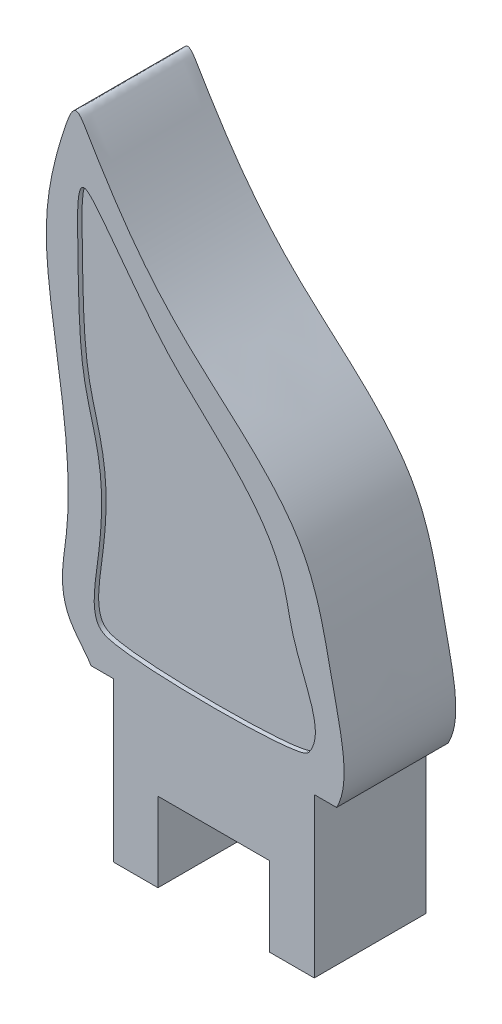
ISO-10303-21;
HEADER;
FILE_DESCRIPTION(('STEP AP214'),'2;1');
FILE_NAME('part.step','',(''),(''),'','','');
FILE_SCHEMA(('AUTOMOTIVE_DESIGN { 1 0 10303 214 1 1 1 1 }'));
ENDSEC;
DATA;
#1=APPLICATION_CONTEXT('core data for automotive mechanical design processes');
#2=APPLICATION_PROTOCOL_DEFINITION('international standard','automotive_design',2000,#1);
#3=PRODUCT_CONTEXT('',#1,'mechanical');
#4=PRODUCT('Part','Part','',(#3));
#5=PRODUCT_RELATED_PRODUCT_CATEGORY('part','',(#4));
#6=PRODUCT_DEFINITION_FORMATION('','',#4);
#7=PRODUCT_DEFINITION_CONTEXT('part definition',#1,'design');
#8=PRODUCT_DEFINITION('design','',#6,#7);
#9=PRODUCT_DEFINITION_SHAPE('','',#8);
#10=(LENGTH_UNIT() NAMED_UNIT(*) SI_UNIT(.MILLI.,.METRE.));
#11=(NAMED_UNIT(*) PLANE_ANGLE_UNIT() SI_UNIT($,.RADIAN.));
#12=(NAMED_UNIT(*) SI_UNIT($,.STERADIAN.) SOLID_ANGLE_UNIT());
#13=UNCERTAINTY_MEASURE_WITH_UNIT(LENGTH_MEASURE(1.E-05),#10,'distance_accuracy_value','');
#14=(GEOMETRIC_REPRESENTATION_CONTEXT(3) GLOBAL_UNCERTAINTY_ASSIGNED_CONTEXT((#13)) GLOBAL_UNIT_ASSIGNED_CONTEXT((#10,
#11,#12)) REPRESENTATION_CONTEXT('',''));
#15=CARTESIAN_POINT('',(0.,0.,0.));
#16=DIRECTION('',(0.,0.,1.));
#17=DIRECTION('',(1.,0.,0.));
#18=AXIS2_PLACEMENT_3D('',#15,#16,#17);
#19=CARTESIAN_POINT('',(-26.5426129547652,-9.52823658466999,13.5506965832842));
#20=DIRECTION('',(0.,1.,0.));
#21=DIRECTION('',(0.,0.,1.));
#22=AXIS2_PLACEMENT_3D('',#19,#20,#21);
#23=PLANE('',#22);
#24=DIRECTION('',(-1.,0.,0.));
#25=VECTOR('',#24,1.);
#26=CARTESIAN_POINT('',(-26.5426129547652,-9.52823658466999,13.5506965832842));
#27=LINE('',#26,#25);
#28=CARTESIAN_POINT('',(-22.8426129547652,-9.52823658467004,13.5506965832842));
#29=VERTEX_POINT('',#28);
#30=CARTESIAN_POINT('',(-23.8426129547652,-9.52823658467002,13.5506965832842));
#31=VERTEX_POINT('',#30);
#32=EDGE_CURVE('E156',#29,#31,#27,.T.);
#33=ORIENTED_EDGE('',*,*,#32,.T.);
#34=DIRECTION('',(0.,0.,1.));
#35=VECTOR('',#34,1.);
#36=CARTESIAN_POINT('',(-23.8426129547652,-9.52823658467002,11.0506965832842));
#37=LINE('',#36,#35);
#38=CARTESIAN_POINT('',(-23.8426129547652,-9.52823658467002,11.0506965832842));
#39=VERTEX_POINT('',#38);
#40=EDGE_CURVE('E135',#39,#31,#37,.T.);
#41=ORIENTED_EDGE('',*,*,#40,.F.);
#42=DIRECTION('',(-1.,0.,0.));
#43=VECTOR('',#42,1.);
#44=CARTESIAN_POINT('',(-26.5426129547652,-9.52823658466999,11.0506965832842));
#45=LINE('',#44,#43);
#46=CARTESIAN_POINT('',(-22.8426129547652,-9.52823658467004,11.0506965832842));
#47=VERTEX_POINT('',#46);
#48=EDGE_CURVE('E167',#47,#39,#45,.T.);
#49=ORIENTED_EDGE('',*,*,#48,.F.);
#50=DIRECTION('',(0.,0.,-1.));
#51=VECTOR('',#50,1.);
#52=CARTESIAN_POINT('',(-22.8426129547652,-9.52823658467004,13.5506965832842));
#53=LINE('',#52,#51);
#54=EDGE_CURVE('E166',#29,#47,#53,.T.);
#55=ORIENTED_EDGE('',*,*,#54,.F.);
#56=EDGE_LOOP('',(#33,#41,#49,#55));
#57=FACE_BOUND('',#56,.T.);
#58=ADVANCED_FACE('F43',(#57),#23,.F.);
#59=CARTESIAN_POINT('',(-26.5426129547652,-5.97122894272822,13.5506965832842));
#60=DIRECTION('',(0.,1.,0.));
#61=DIRECTION('',(0.,0.,1.));
#62=AXIS2_PLACEMENT_3D('',#59,#60,#61);
#63=PLANE('',#62);
#64=DIRECTION('',(0.,0.,-1.));
#65=VECTOR('',#64,1.);
#66=CARTESIAN_POINT('',(-27.3426129547652,-5.97122894272821,13.5506965832842));
#67=LINE('',#66,#65);
#68=CARTESIAN_POINT('',(-27.3426129547652,-5.97122894272821,13.5506965832842));
#69=VERTEX_POINT('',#68);
#70=CARTESIAN_POINT('',(-27.3426129547652,-5.97122894272821,11.0506965832842));
#71=VERTEX_POINT('',#70);
#72=EDGE_CURVE('E185',#69,#71,#67,.T.);
#73=ORIENTED_EDGE('',*,*,#72,.F.);
#74=DIRECTION('',(-1.,0.,0.));
#75=VECTOR('',#74,1.);
#76=CARTESIAN_POINT('',(-26.5426129547652,-5.97122894272822,13.5506965832842));
#77=LINE('',#76,#75);
#78=CARTESIAN_POINT('',(-27.8426129547652,-5.9712289427282,13.5506965832842));
#79=VERTEX_POINT('',#78);
#80=EDGE_CURVE('E234',#69,#79,#77,.T.);
#81=ORIENTED_EDGE('',*,*,#80,.T.);
#82=DIRECTION('',(0.,0.,-1.));
#83=VECTOR('',#82,1.);
#84=CARTESIAN_POINT('',(-27.8426129547652,-5.9712289427282,13.5506965832842));
#85=LINE('',#84,#83);
#86=CARTESIAN_POINT('',(-27.8426129547652,-5.9712289427282,11.0506965832842));
#87=VERTEX_POINT('',#86);
#88=EDGE_CURVE('E53',#79,#87,#85,.T.);
#89=ORIENTED_EDGE('',*,*,#88,.T.);
#90=DIRECTION('',(-1.,0.,0.));
#91=VECTOR('',#90,1.);
#92=CARTESIAN_POINT('',(-26.5426129547652,-5.97122894272822,11.0506965832842));
#93=LINE('',#92,#91);
#94=EDGE_CURVE('E236',#71,#87,#93,.T.);
#95=ORIENTED_EDGE('',*,*,#94,.F.);
#96=EDGE_LOOP('',(#73,#81,#89,#95));
#97=FACE_BOUND('',#96,.T.);
#98=ADVANCED_FACE('F219',(#97),#63,.F.);
#99=DIRECTION('',(0.,0.,-1.));
#100=VECTOR('',#99,1.);
#101=CARTESIAN_POINT('',(-22.8426129547652,-5.97122894272827,13.5506965832842));
#102=LINE('',#101,#100);
#103=CARTESIAN_POINT('',(-22.8426129547652,-5.97122894272827,13.5506965832842));
#104=VERTEX_POINT('',#103);
#105=CARTESIAN_POINT('',(-22.8426129547652,-5.97122894272827,11.0506965832842));
#106=VERTEX_POINT('',#105);
#107=EDGE_CURVE('E181',#104,#106,#102,.T.);
#108=ORIENTED_EDGE('',*,*,#107,.T.);
#109=CARTESIAN_POINT('',(-22.3426129547652,-5.97122894272828,11.0506965832842));
#110=VERTEX_POINT('',#109);
#111=EDGE_CURVE('E271',#110,#106,#93,.T.);
#112=ORIENTED_EDGE('',*,*,#111,.F.);
#113=DIRECTION('',(0.,0.,-1.));
#114=VECTOR('',#113,1.);
#115=CARTESIAN_POINT('',(-22.3426129547652,-5.97122894272828,13.5506965832842));
#116=LINE('',#115,#114);
#117=CARTESIAN_POINT('',(-22.3426129547652,-5.97122894272828,13.5506965832842));
#118=VERTEX_POINT('',#117);
#119=EDGE_CURVE('E11',#118,#110,#116,.T.);
#120=ORIENTED_EDGE('',*,*,#119,.F.);
#121=EDGE_CURVE('E263',#118,#104,#77,.T.);
#122=ORIENTED_EDGE('',*,*,#121,.T.);
#123=EDGE_LOOP('',(#108,#112,#120,#122));
#124=FACE_BOUND('',#123,.T.);
#125=ADVANCED_FACE('F221',(#124),#63,.F.);
#126=CARTESIAN_POINT('',(-22.3426129547652,-5.97122894272828,13.5506965832842));
#127=CARTESIAN_POINT('',(-22.0230958119888,-5.37784989323537,13.5506965832842));
#128=CARTESIAN_POINT('',(-22.476666305526,-3.5915199593753,13.5506965832842));
#129=CARTESIAN_POINT('',(-22.9043423705748,-0.946207776332204,13.5506965832842));
#130=CARTESIAN_POINT('',(-25.8610974247674,1.32350664095958,13.5506965832842));
#131=CARTESIAN_POINT('',(-27.123031369236,2.93701143766191,13.5506965832842));
#132=CARTESIAN_POINT('',(-28.2060932322281,4.80524596514836,13.5506965832842));
#133=CARTESIAN_POINT('',(-28.8429195048468,3.04117219746357,13.5506965832842));
#134=CARTESIAN_POINT('',(-28.9578405042136,0.820328884380956,13.5506965832842));
#135=CARTESIAN_POINT('',(-28.0435306222221,-2.64810633493801,13.5506965832842));
#136=CARTESIAN_POINT('',(-28.6575367971811,-5.0691905645615,13.5506965832842));
#137=CARTESIAN_POINT('',(-27.9378085228159,-5.80356095091444,13.5506965832842));
#138=CARTESIAN_POINT('',(-27.8426129547652,-5.9712289427282,13.5506965832842));
#139=B_SPLINE_CURVE_WITH_KNOTS('',3,(#126,#127,#128,#129,#130,#131,#132,#133,#134,#135,#136,
#137,#138),.UNSPECIFIED.,.F.,.F.,(4,1,1,1,1,1,1,1,1,1,4),(0.,0.0749361636008755,
0.165228530478853,0.281937543117569,0.421795129781682,0.434470620733134,0.452060542403782,
0.554607140477326,0.727323585221969,0.786428047502561,0.806469758436259),.UNSPECIFIED.);
#140=DIRECTION('',(0.,0.,-1.));
#141=VECTOR('',#140,1.);
#142=SURFACE_OF_LINEAR_EXTRUSION('',#139,#141);
#143=CARTESIAN_POINT('',(-22.3426129547652,-5.97122894272828,11.0506965832842));
#144=CARTESIAN_POINT('',(-22.0230958119888,-5.37784989323537,11.0506965832842));
#145=CARTESIAN_POINT('',(-22.476666305526,-3.5915199593753,11.0506965832842));
#146=CARTESIAN_POINT('',(-22.9043423705748,-0.946207776332204,11.0506965832842));
#147=CARTESIAN_POINT('',(-25.8610974247674,1.32350664095958,11.0506965832842));
#148=CARTESIAN_POINT('',(-27.123031369236,2.93701143766191,11.0506965832842));
#149=CARTESIAN_POINT('',(-28.2060932322281,4.80524596514836,11.0506965832842));
#150=CARTESIAN_POINT('',(-28.8429195048468,3.04117219746357,11.0506965832842));
#151=CARTESIAN_POINT('',(-28.9578405042136,0.820328884380956,11.0506965832842));
#152=CARTESIAN_POINT('',(-28.0435306222221,-2.64810633493801,11.0506965832842));
#153=CARTESIAN_POINT('',(-28.6575367971811,-5.0691905645615,11.0506965832842));
#154=CARTESIAN_POINT('',(-27.9378085228159,-5.80356095091444,11.0506965832842));
#155=CARTESIAN_POINT('',(-27.8426129547652,-5.9712289427282,11.0506965832842));
#156=B_SPLINE_CURVE_WITH_KNOTS('',3,(#143,#144,#145,#146,#147,#148,#149,#150,#151,#152,#153,
#154,#155),.UNSPECIFIED.,.F.,.F.,(4,1,1,1,1,1,1,1,1,1,4),(0.,0.0749361636008755,
0.165228530478853,0.281937543117569,0.421795129781682,0.434470620733134,0.452060542403782,
0.554607140477326,0.727323585221969,0.786428047502561,0.806469758436259),.UNSPECIFIED.);
#157=EDGE_CURVE('E200',#110,#87,#156,.T.);
#158=ORIENTED_EDGE('',*,*,#157,.T.);
#159=ORIENTED_EDGE('',*,*,#88,.F.);
#160=EDGE_CURVE('E273',#118,#79,#139,.T.);
#161=ORIENTED_EDGE('',*,*,#160,.F.);
#162=ORIENTED_EDGE('',*,*,#119,.T.);
#163=EDGE_LOOP('',(#158,#159,#161,#162));
#164=FACE_BOUND('',#163,.T.);
#165=ADVANCED_FACE('F45',(#164),#142,.F.);
#166=CARTESIAN_POINT('',(-26.5426129547652,-3.18748383164336,13.5506965832842));
#167=DIRECTION('',(0.,0.,1.));
#168=DIRECTION('',(-1.,0.,0.));
#169=AXIS2_PLACEMENT_3D('',#166,#167,#168);
#170=PLANE('',#169);
#171=DIRECTION('',(0.,-1.,0.));
#172=VECTOR('',#171,1.);
#173=CARTESIAN_POINT('',(-23.8426129547652,-7.75323658467003,13.5506965832842));
#174=LINE('',#173,#172);
#175=CARTESIAN_POINT('',(-23.8426129547652,-7.75323658467003,13.5506965832842));
#176=VERTEX_POINT('',#175);
#177=EDGE_CURVE('E242',#176,#31,#174,.T.);
#178=ORIENTED_EDGE('',*,*,#177,.T.);
#179=ORIENTED_EDGE('',*,*,#32,.F.);
#180=DIRECTION('',(0.,-1.,0.));
#181=VECTOR('',#180,1.);
#182=CARTESIAN_POINT('',(-22.8426129547652,-3.18748383164341,13.5506965832842));
#183=LINE('',#182,#181);
#184=EDGE_CURVE('E162',#104,#29,#183,.T.);
#185=ORIENTED_EDGE('',*,*,#184,.F.);
#186=ORIENTED_EDGE('',*,*,#121,.F.);
#187=ORIENTED_EDGE('',*,*,#160,.T.);
#188=ORIENTED_EDGE('',*,*,#80,.F.);
#189=DIRECTION('',(0.,1.,0.));
#190=VECTOR('',#189,1.);
#191=CARTESIAN_POINT('',(-27.3426129547652,-3.18748383164335,13.5506965832842));
#192=LINE('',#191,#190);
#193=CARTESIAN_POINT('',(-27.3426129547652,-9.52823658466998,13.5506965832842));
#194=VERTEX_POINT('',#193);
#195=EDGE_CURVE('E68',#194,#69,#192,.T.);
#196=ORIENTED_EDGE('',*,*,#195,.F.);
#197=CARTESIAN_POINT('',(-26.3426129547652,-9.52823658466999,13.5506965832842));
#198=VERTEX_POINT('',#197);
#199=EDGE_CURVE('E146',#198,#194,#27,.T.);
#200=ORIENTED_EDGE('',*,*,#199,.F.);
#201=DIRECTION('',(0.,-1.,0.));
#202=VECTOR('',#201,1.);
#203=CARTESIAN_POINT('',(-26.3426129547652,-7.75323658466999,13.5506965832842));
#204=LINE('',#203,#202);
#205=CARTESIAN_POINT('',(-26.3426129547652,-7.75323658466999,13.5506965832842));
#206=VERTEX_POINT('',#205);
#207=EDGE_CURVE('E60',#206,#198,#204,.T.);
#208=ORIENTED_EDGE('',*,*,#207,.F.);
#209=DIRECTION('',(-1.,0.,0.));
#210=VECTOR('',#209,1.);
#211=CARTESIAN_POINT('',(-25.0926129547652,-7.75323658467001,13.5506965832842));
#212=LINE('',#211,#210);
#213=EDGE_CURVE('E126',#176,#206,#212,.T.);
#214=ORIENTED_EDGE('',*,*,#213,.F.);
#215=EDGE_LOOP('',(#178,#179,#185,#186,#187,#188,#196,#200,#208,#214));
#216=FACE_BOUND('',#215,.T.);
#217=CARTESIAN_POINT('',(-22.9522645229755,-5.19421147208946,13.5506965832842));
#218=CARTESIAN_POINT('',(-22.9709410965969,-5.22115989117163,13.5506965832842));
#219=CARTESIAN_POINT('',(-23.1586212924115,-5.46003071747665,13.5506965832842));
#220=CARTESIAN_POINT('',(-27.1789035574811,-5.4606570765367,13.5506965832842));
#221=CARTESIAN_POINT('',(-27.8883258917649,-5.01226361383346,13.5506965832842));
#222=CARTESIAN_POINT('',(-27.6967224510555,-4.04113415649767,13.5506965832842));
#223=CARTESIAN_POINT('',(-27.4970292340678,-1.91231233528831,13.5506965832842));
#224=CARTESIAN_POINT('',(-28.1096483680195,-0.804352241865151,13.5506965832842));
#225=CARTESIAN_POINT('',(-28.1218574173366,1.22327984363848,13.5506965832842));
#226=CARTESIAN_POINT('',(-28.1507460122598,2.64192205723021,13.5506965832842));
#227=CARTESIAN_POINT('',(-28.141888489581,3.50029254431418,13.5506965832842));
#228=CARTESIAN_POINT('',(-27.0498753439552,2.1587205464398,13.5506965832842));
#229=CARTESIAN_POINT('',(-25.9837637799735,0.509340642368262,13.5506965832842));
#230=CARTESIAN_POINT('',(-23.6589432344306,-1.12787737059045,13.5506965832842));
#231=CARTESIAN_POINT('',(-23.2697865684945,-3.69375030836592,13.5506965832842));
#232=CARTESIAN_POINT('',(-22.563664459271,-4.63350062735142,13.5506965832842));
#233=CARTESIAN_POINT('',(-22.9522645229755,-5.19421147208946,13.5506965832842));
#234=B_SPLINE_CURVE_WITH_KNOTS('',3,(#217,#218,#219,#220,#221,#222,#223,#224,#225,#226,#227,
#228,#229,#230,#231,#232,#233),.UNSPECIFIED.,.T.,.F.,(4,1,1,1,1,1,1,1,1,1,1,1,1,1,4),(0.,
0.00719457443202198,0.0647511698881983,0.0774379970756104,0.121376019118732,0.138945306145948,
0.247638614592384,0.345159243137374,0.361830102418278,0.414347207401426,0.440003173782858,
0.588193752268276,0.809123176165587,0.85030380093876,1.),.UNSPECIFIED.);
#235=CARTESIAN_POINT('',(-22.9522645229755,-5.19421147208946,13.5506965832842));
#236=VERTEX_POINT('',#235);
#237=EDGE_CURVE('E192',#236,#236,#234,.T.);
#238=ORIENTED_EDGE('',*,*,#237,.T.);
#239=EDGE_LOOP('',(#238));
#240=FACE_BOUND('',#239,.T.);
#241=ADVANCED_FACE('F144',(#216,#240),#170,.T.);
#242=CARTESIAN_POINT('',(-26.5426129547652,-3.18748383164336,11.0506965832842));
#243=DIRECTION('',(0.,0.,1.));
#244=DIRECTION('',(-1.,0.,0.));
#245=AXIS2_PLACEMENT_3D('',#242,#243,#244);
#246=PLANE('',#245);
#247=ORIENTED_EDGE('',*,*,#48,.T.);
#248=DIRECTION('',(0.,-1.,0.));
#249=VECTOR('',#248,1.);
#250=CARTESIAN_POINT('',(-23.8426129547652,-7.75323658467003,11.0506965832842));
#251=LINE('',#250,#249);
#252=CARTESIAN_POINT('',(-23.8426129547652,-7.75323658467003,11.0506965832842));
#253=VERTEX_POINT('',#252);
#254=EDGE_CURVE('E151',#253,#39,#251,.T.);
#255=ORIENTED_EDGE('',*,*,#254,.F.);
#256=DIRECTION('',(1.,0.,0.));
#257=VECTOR('',#256,1.);
#258=CARTESIAN_POINT('',(-26.3426129547652,-7.75323658466999,11.0506965832842));
#259=LINE('',#258,#257);
#260=CARTESIAN_POINT('',(-26.3426129547652,-7.75323658466999,11.0506965832842));
#261=VERTEX_POINT('',#260);
#262=EDGE_CURVE('E141',#261,#253,#259,.T.);
#263=ORIENTED_EDGE('',*,*,#262,.F.);
#264=DIRECTION('',(0.,-1.,0.));
#265=VECTOR('',#264,1.);
#266=CARTESIAN_POINT('',(-26.3426129547652,-7.75323658466999,11.0506965832842));
#267=LINE('',#266,#265);
#268=CARTESIAN_POINT('',(-26.3426129547652,-9.52823658466999,11.0506965832842));
#269=VERTEX_POINT('',#268);
#270=EDGE_CURVE('E139',#261,#269,#267,.T.);
#271=ORIENTED_EDGE('',*,*,#270,.T.);
#272=CARTESIAN_POINT('',(-27.3426129547652,-9.52823658466998,11.0506965832842));
#273=VERTEX_POINT('',#272);
#274=EDGE_CURVE('E172',#269,#273,#45,.T.);
#275=ORIENTED_EDGE('',*,*,#274,.T.);
#276=DIRECTION('',(0.,1.,0.));
#277=VECTOR('',#276,1.);
#278=CARTESIAN_POINT('',(-27.3426129547652,-3.18748383164335,11.0506965832842));
#279=LINE('',#278,#277);
#280=EDGE_CURVE('E171',#273,#71,#279,.T.);
#281=ORIENTED_EDGE('',*,*,#280,.T.);
#282=ORIENTED_EDGE('',*,*,#94,.T.);
#283=ORIENTED_EDGE('',*,*,#157,.F.);
#284=ORIENTED_EDGE('',*,*,#111,.T.);
#285=DIRECTION('',(0.,-1.,0.));
#286=VECTOR('',#285,1.);
#287=CARTESIAN_POINT('',(-22.8426129547652,-3.18748383164341,11.0506965832842));
#288=LINE('',#287,#286);
#289=EDGE_CURVE('E175',#106,#47,#288,.T.);
#290=ORIENTED_EDGE('',*,*,#289,.T.);
#291=EDGE_LOOP('',(#247,#255,#263,#271,#275,#281,#282,#283,#284,#290));
#292=FACE_BOUND('',#291,.T.);
#293=ADVANCED_FACE('F212',(#292),#246,.F.);
#294=CARTESIAN_POINT('',(-22.9522645229755,-5.19421147208946,13.4506965832842));
#295=CARTESIAN_POINT('',(-22.9709410965969,-5.22115989117163,13.4506965832842));
#296=CARTESIAN_POINT('',(-23.1586212924115,-5.46003071747665,13.4506965832842));
#297=CARTESIAN_POINT('',(-27.1789035574811,-5.4606570765367,13.4506965832842));
#298=CARTESIAN_POINT('',(-27.8883258917649,-5.01226361383346,13.4506965832842));
#299=CARTESIAN_POINT('',(-27.6967224510555,-4.04113415649767,13.4506965832842));
#300=CARTESIAN_POINT('',(-27.4970292340678,-1.91231233528831,13.4506965832842));
#301=CARTESIAN_POINT('',(-28.1096483680195,-0.804352241865151,13.4506965832842));
#302=CARTESIAN_POINT('',(-28.1218574173366,1.22327984363848,13.4506965832842));
#303=CARTESIAN_POINT('',(-28.1507460122598,2.64192205723021,13.4506965832842));
#304=CARTESIAN_POINT('',(-28.141888489581,3.50029254431418,13.4506965832842));
#305=CARTESIAN_POINT('',(-27.0498753439552,2.1587205464398,13.4506965832842));
#306=CARTESIAN_POINT('',(-25.9837637799735,0.509340642368262,13.4506965832842));
#307=CARTESIAN_POINT('',(-23.6589432344306,-1.12787737059045,13.4506965832842));
#308=CARTESIAN_POINT('',(-23.2697865684945,-3.69375030836592,13.4506965832842));
#309=CARTESIAN_POINT('',(-22.563664459271,-4.63350062735142,13.4506965832842));
#310=CARTESIAN_POINT('',(-22.9522645229755,-5.19421147208946,13.4506965832842));
#311=B_SPLINE_CURVE_WITH_KNOTS('',3,(#294,#295,#296,#297,#298,#299,#300,#301,#302,#303,#304,
#305,#306,#307,#308,#309,#310),.UNSPECIFIED.,.T.,.F.,(4,1,1,1,1,1,1,1,1,1,1,1,1,1,4),(0.,
0.00719457443202198,0.0647511698881983,0.0774379970756104,0.121376019118732,0.138945306145948,
0.247638614592384,0.345159243137374,0.361830102418278,0.414347207401426,0.440003173782858,
0.588193752268276,0.809123176165587,0.85030380093876,1.),.UNSPECIFIED.);
#312=DIRECTION('',(0.,0.,1.));
#313=VECTOR('',#312,1.);
#314=SURFACE_OF_LINEAR_EXTRUSION('',#311,#313);
#315=CARTESIAN_POINT('',(-22.9522645229755,-5.19421147208946,13.4506965832842));
#316=VERTEX_POINT('',#315);
#317=EDGE_CURVE('E193',#316,#316,#311,.T.);
#318=ORIENTED_EDGE('',*,*,#317,.T.);
#319=EDGE_LOOP('',(#318));
#320=FACE_BOUND('',#319,.T.);
#321=ORIENTED_EDGE('',*,*,#237,.F.);
#322=EDGE_LOOP('',(#321));
#323=FACE_BOUND('',#322,.T.);
#324=ADVANCED_FACE('F207',(#320,#323),#314,.T.);
#325=CARTESIAN_POINT('',(-26.9395501709995,1.96597092627967,13.4506965832842));
#326=DIRECTION('',(0.,0.,1.));
#327=DIRECTION('',(-1.,0.,0.));
#328=AXIS2_PLACEMENT_3D('',#325,#326,#327);
#329=PLANE('',#328);
#330=ORIENTED_EDGE('',*,*,#317,.F.);
#331=EDGE_LOOP('',(#330));
#332=FACE_BOUND('',#331,.T.);
#333=ADVANCED_FACE('F211',(#332),#329,.T.);
#334=ORIENTED_EDGE('',*,*,#274,.F.);
#335=DIRECTION('',(0.,0.,-1.));
#336=VECTOR('',#335,1.);
#337=CARTESIAN_POINT('',(-26.3426129547652,-9.52823658466999,13.5506965832842));
#338=LINE('',#337,#336);
#339=EDGE_CURVE('E243',#198,#269,#338,.T.);
#340=ORIENTED_EDGE('',*,*,#339,.F.);
#341=ORIENTED_EDGE('',*,*,#199,.T.);
#342=DIRECTION('',(0.,0.,-1.));
#343=VECTOR('',#342,1.);
#344=CARTESIAN_POINT('',(-27.3426129547652,-9.52823658466998,13.5506965832842));
#345=LINE('',#344,#343);
#346=EDGE_CURVE('E188',#194,#273,#345,.T.);
#347=ORIENTED_EDGE('',*,*,#346,.T.);
#348=EDGE_LOOP('',(#334,#340,#341,#347));
#349=FACE_BOUND('',#348,.T.);
#350=ADVANCED_FACE('F229',(#349),#23,.F.);
#351=CARTESIAN_POINT('',(-27.3426129547652,-3.18748383164335,13.5506965832842));
#352=DIRECTION('',(1.,0.,0.));
#353=DIRECTION('',(0.,0.,1.));
#354=AXIS2_PLACEMENT_3D('',#351,#352,#353);
#355=PLANE('',#354);
#356=ORIENTED_EDGE('',*,*,#280,.F.);
#357=ORIENTED_EDGE('',*,*,#346,.F.);
#358=ORIENTED_EDGE('',*,*,#195,.T.);
#359=ORIENTED_EDGE('',*,*,#72,.T.);
#360=EDGE_LOOP('',(#356,#357,#358,#359));
#361=FACE_BOUND('',#360,.T.);
#362=ADVANCED_FACE('F238',(#361),#355,.F.);
#363=CARTESIAN_POINT('',(-22.8426129547652,-3.18748383164341,13.5506965832842));
#364=DIRECTION('',(-1.,0.,0.));
#365=DIRECTION('',(0.,0.,-1.));
#366=AXIS2_PLACEMENT_3D('',#363,#364,#365);
#367=PLANE('',#366);
#368=ORIENTED_EDGE('',*,*,#289,.F.);
#369=ORIENTED_EDGE('',*,*,#107,.F.);
#370=ORIENTED_EDGE('',*,*,#184,.T.);
#371=ORIENTED_EDGE('',*,*,#54,.T.);
#372=EDGE_LOOP('',(#368,#369,#370,#371));
#373=FACE_BOUND('',#372,.T.);
#374=ADVANCED_FACE('F270',(#373),#367,.F.);
#375=CARTESIAN_POINT('',(-23.8426129547652,-7.75323658467003,11.0506965832842));
#376=DIRECTION('',(1.,0.,0.));
#377=DIRECTION('',(0.,1.,0.));
#378=AXIS2_PLACEMENT_3D('',#375,#376,#377);
#379=PLANE('',#378);
#380=ORIENTED_EDGE('',*,*,#40,.T.);
#381=ORIENTED_EDGE('',*,*,#177,.F.);
#382=DIRECTION('',(0.,0.,1.));
#383=VECTOR('',#382,1.);
#384=CARTESIAN_POINT('',(-23.8426129547652,-7.75323658467003,11.0506965832842));
#385=LINE('',#384,#383);
#386=EDGE_CURVE('E131',#253,#176,#385,.T.);
#387=ORIENTED_EDGE('',*,*,#386,.F.);
#388=ORIENTED_EDGE('',*,*,#254,.T.);
#389=EDGE_LOOP('',(#380,#381,#387,#388));
#390=FACE_BOUND('',#389,.T.);
#391=ADVANCED_FACE('F257',(#390),#379,.F.);
#392=CARTESIAN_POINT('',(-26.3426129547652,-7.75323658466999,13.5506965832842));
#393=DIRECTION('',(-1.,0.,0.));
#394=DIRECTION('',(0.,-1.,0.));
#395=AXIS2_PLACEMENT_3D('',#392,#393,#394);
#396=PLANE('',#395);
#397=ORIENTED_EDGE('',*,*,#339,.T.);
#398=ORIENTED_EDGE('',*,*,#270,.F.);
#399=DIRECTION('',(0.,0.,-1.));
#400=VECTOR('',#399,1.);
#401=CARTESIAN_POINT('',(-26.3426129547652,-7.75323658466999,13.5506965832842));
#402=LINE('',#401,#400);
#403=EDGE_CURVE('E128',#206,#261,#402,.T.);
#404=ORIENTED_EDGE('',*,*,#403,.F.);
#405=ORIENTED_EDGE('',*,*,#207,.T.);
#406=EDGE_LOOP('',(#397,#398,#404,#405));
#407=FACE_BOUND('',#406,.T.);
#408=ADVANCED_FACE('F137',(#407),#396,.F.);
#409=CARTESIAN_POINT('',(-1.07441327998924E-13,-7.75323658467036,0.));
#410=DIRECTION('',(0.,-1.,0.));
#411=DIRECTION('',(1.,0.,0.));
#412=AXIS2_PLACEMENT_3D('',#409,#410,#411);
#413=PLANE('',#412);
#414=ORIENTED_EDGE('',*,*,#213,.T.);
#415=ORIENTED_EDGE('',*,*,#403,.T.);
#416=ORIENTED_EDGE('',*,*,#262,.T.);
#417=ORIENTED_EDGE('',*,*,#386,.T.);
#418=EDGE_LOOP('',(#414,#415,#416,#417));
#419=FACE_BOUND('',#418,.T.);
#420=ADVANCED_FACE('F127',(#419),#413,.T.);
#421=CLOSED_SHELL('',(#58,#98,#125,#165,#241,#293,#324,#333,#350,#362,#374,#391,#408,#420));
#422=MANIFOLD_SOLID_BREP('B2',#421);
#423=ADVANCED_BREP_SHAPE_REPRESENTATION('',(#18,#422),#14);
#424=SHAPE_DEFINITION_REPRESENTATION(#9,#423);
ENDSEC;
END-ISO-10303-21;
